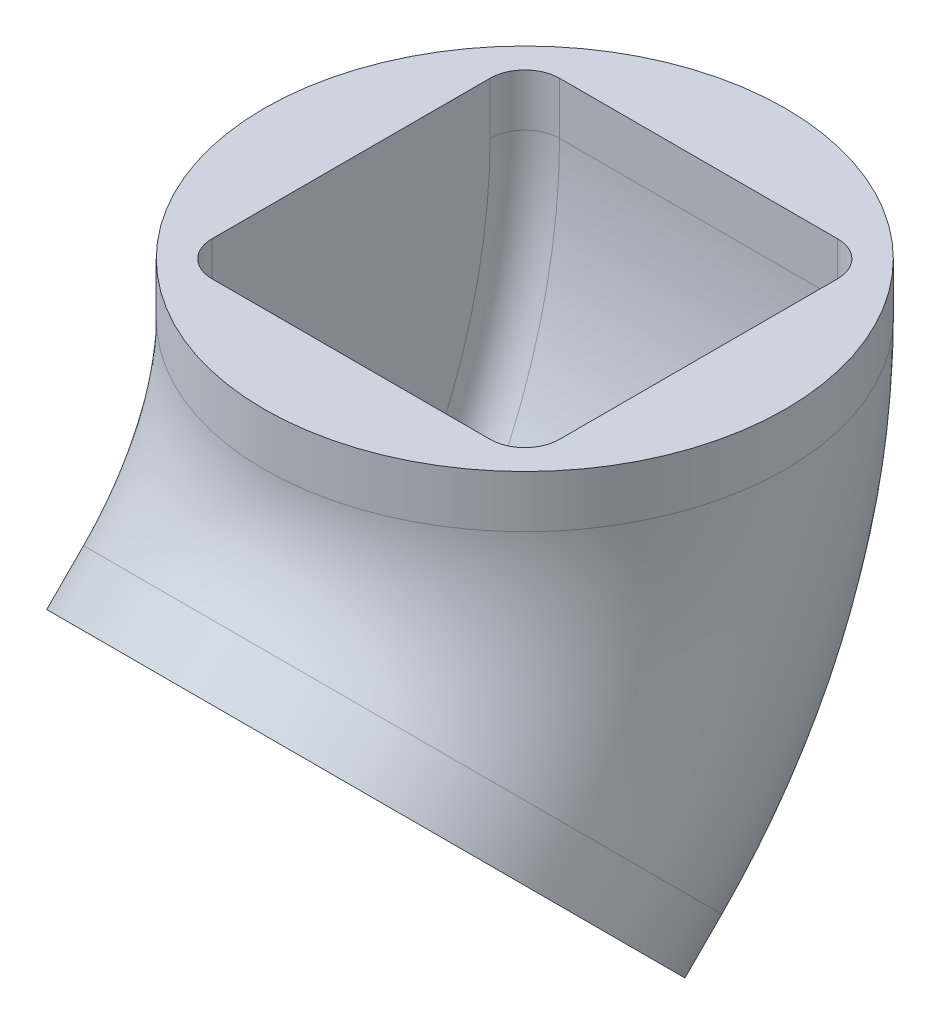
ISO-10303-21;
HEADER;
FILE_DESCRIPTION(('STEP AP214'),'2;1');
FILE_NAME('part.step','',(''),(''),'','','');
FILE_SCHEMA(('AUTOMOTIVE_DESIGN { 1 0 10303 214 1 1 1 1 }'));
ENDSEC;
DATA;
#1=APPLICATION_CONTEXT('core data for automotive mechanical design processes');
#2=APPLICATION_PROTOCOL_DEFINITION('international standard','automotive_design',2000,#1);
#3=PRODUCT_CONTEXT('',#1,'mechanical');
#4=PRODUCT('Part','Part','',(#3));
#5=PRODUCT_RELATED_PRODUCT_CATEGORY('part','',(#4));
#6=PRODUCT_DEFINITION_FORMATION('','',#4);
#7=PRODUCT_DEFINITION_CONTEXT('part definition',#1,'design');
#8=PRODUCT_DEFINITION('design','',#6,#7);
#9=PRODUCT_DEFINITION_SHAPE('','',#8);
#10=(LENGTH_UNIT() NAMED_UNIT(*) SI_UNIT(.MILLI.,.METRE.));
#11=(NAMED_UNIT(*) PLANE_ANGLE_UNIT() SI_UNIT($,.RADIAN.));
#12=(NAMED_UNIT(*) SI_UNIT($,.STERADIAN.) SOLID_ANGLE_UNIT());
#13=UNCERTAINTY_MEASURE_WITH_UNIT(LENGTH_MEASURE(1.E-05),#10,'distance_accuracy_value','');
#14=(GEOMETRIC_REPRESENTATION_CONTEXT(3) GLOBAL_UNCERTAINTY_ASSIGNED_CONTEXT((#13)) GLOBAL_UNIT_ASSIGNED_CONTEXT((#10,
#11,#12)) REPRESENTATION_CONTEXT('',''));
#15=CARTESIAN_POINT('',(0.,0.,0.));
#16=DIRECTION('',(0.,0.,1.));
#17=DIRECTION('',(1.,0.,0.));
#18=AXIS2_PLACEMENT_3D('',#15,#16,#17);
#19=CARTESIAN_POINT('',(0.,-84.8528137423858,35.1471862576145));
#20=DIRECTION('',(0.,-0.707106781186546,0.707106781186548));
#21=DIRECTION('',(0.,-0.707106781186549,-0.707106781186547));
#22=AXIS2_PLACEMENT_3D('',#19,#20,#21);
#23=PLANE('',#22);
#24=DIRECTION('',(0.,0.707106781186549,0.707106781186547));
#25=VECTOR('',#24,1.);
#26=CARTESIAN_POINT('',(50.,-113.137084989848,6.86291501015256));
#27=LINE('',#26,#25);
#28=CARTESIAN_POINT('',(50.,-57.7511532766505,62.2488467233497));
#29=VERTEX_POINT('',#28);
#30=CARTESIAN_POINT('',(50.,-111.954474208121,8.04552579187919));
#31=VERTEX_POINT('',#30);
#32=EDGE_CURVE('E180',#29,#31,#27,.F.);
#33=ORIENTED_EDGE('',*,*,#32,.T.);
#34=CARTESIAN_POINT('',(0.,-84.8528137423858,35.1471862576144));
#35=DIRECTION('',(0.,-0.707106781186547,0.707106781186548));
#36=DIRECTION('',(0.,-0.707106781186548,-0.707106781186547));
#37=AXIS2_PLACEMENT_3D('',#34,#35,#36);
#38=CIRCLE('',#37,63.);
#39=EDGE_CURVE('E11',#31,#29,#38,.T.);
#40=ORIENTED_EDGE('',*,*,#39,.T.);
#41=EDGE_LOOP('',(#33,#40));
#42=FACE_BOUND('',#41,.T.);
#43=ADVANCED_FACE('F43',(#42),#23,.T.);
#44=DIRECTION('',(-1.,0.,0.));
#45=VECTOR('',#44,1.);
#46=CARTESIAN_POINT('',(40.,-49.4974746830584,70.5025253169418));
#47=LINE('',#46,#45);
#48=CARTESIAN_POINT('',(-38.3275357934736,-49.4974746830584,70.5025253169418));
#49=VERTEX_POINT('',#48);
#50=CARTESIAN_POINT('',(38.3275357934736,-49.4974746830584,70.5025253169418));
#51=VERTEX_POINT('',#50);
#52=EDGE_CURVE('E296',#49,#51,#47,.F.);
#53=ORIENTED_EDGE('',*,*,#52,.T.);
#54=EDGE_CURVE('E52',#51,#49,#38,.T.);
#55=ORIENTED_EDGE('',*,*,#54,.T.);
#56=EDGE_LOOP('',(#53,#55));
#57=FACE_BOUND('',#56,.T.);
#58=ADVANCED_FACE('F316',(#57),#23,.T.);
#59=DIRECTION('',(0.,-0.707106781186549,-0.707106781186547));
#60=VECTOR('',#59,1.);
#61=CARTESIAN_POINT('',(-50.,-56.5685424949239,63.4314575050763));
#62=LINE('',#61,#60);
#63=CARTESIAN_POINT('',(-50.,-111.954474208121,8.04552579187919));
#64=VERTEX_POINT('',#63);
#65=CARTESIAN_POINT('',(-50.,-57.7511532766505,62.2488467233497));
#66=VERTEX_POINT('',#65);
#67=EDGE_CURVE('E210',#64,#66,#62,.F.);
#68=ORIENTED_EDGE('',*,*,#67,.T.);
#69=EDGE_CURVE('E276',#66,#64,#38,.T.);
#70=ORIENTED_EDGE('',*,*,#69,.T.);
#71=EDGE_LOOP('',(#68,#70));
#72=FACE_BOUND('',#71,.T.);
#73=ADVANCED_FACE('F334',(#72),#23,.T.);
#74=DIRECTION('',(1.,0.,0.));
#75=VECTOR('',#74,1.);
#76=CARTESIAN_POINT('',(-40.,-120.208152801713,-0.208152801712901));
#77=LINE('',#76,#75);
#78=CARTESIAN_POINT('',(38.3275357934736,-120.208152801713,-0.208152801712908));
#79=VERTEX_POINT('',#78);
#80=CARTESIAN_POINT('',(-38.3275357934736,-120.208152801713,-0.208152801712908));
#81=VERTEX_POINT('',#80);
#82=EDGE_CURVE('E198',#79,#81,#77,.F.);
#83=ORIENTED_EDGE('',*,*,#82,.T.);
#84=EDGE_CURVE('E174',#81,#79,#38,.T.);
#85=ORIENTED_EDGE('',*,*,#84,.T.);
#86=EDGE_LOOP('',(#83,#85));
#87=FACE_BOUND('',#86,.T.);
#88=ADVANCED_FACE('F331',(#87),#23,.T.);
#89=CARTESIAN_POINT('',(0.,15.,0.));
#90=DIRECTION('',(0.,1.,0.));
#91=DIRECTION('',(0.,0.,1.));
#92=AXIS2_PLACEMENT_3D('',#89,#90,#91);
#93=PLANE('',#92);
#94=CARTESIAN_POINT('',(0.,15.,0.));
#95=DIRECTION('',(0.,1.,0.));
#96=DIRECTION('',(0.,0.,1.));
#97=AXIS2_PLACEMENT_3D('',#94,#95,#96);
#98=CIRCLE('',#97,75.);
#99=CARTESIAN_POINT('',(0.,15.,75.));
#100=VERTEX_POINT('',#99);
#101=EDGE_CURVE('E231',#100,#100,#98,.T.);
#102=ORIENTED_EDGE('',*,*,#101,.T.);
#103=EDGE_LOOP('',(#102));
#104=FACE_BOUND('',#103,.T.);
#105=DIRECTION('',(-1.,0.,0.));
#106=VECTOR('',#105,1.);
#107=CARTESIAN_POINT('',(-50.,15.,-50.));
#108=LINE('',#107,#106);
#109=CARTESIAN_POINT('',(40.,15.,-50.));
#110=VERTEX_POINT('',#109);
#111=CARTESIAN_POINT('',(-40.,15.,-50.));
#112=VERTEX_POINT('',#111);
#113=EDGE_CURVE('E222',#110,#112,#108,.T.);
#114=ORIENTED_EDGE('',*,*,#113,.F.);
#115=CARTESIAN_POINT('',(40.,15.,-40.));
#116=DIRECTION('',(0.,1.,0.));
#117=DIRECTION('',(0.,0.,1.));
#118=AXIS2_PLACEMENT_3D('',#115,#116,#117);
#119=CIRCLE('',#118,10.);
#120=CARTESIAN_POINT('',(50.,15.,-40.));
#121=VERTEX_POINT('',#120);
#122=EDGE_CURVE('E47',#110,#121,#119,.F.);
#123=ORIENTED_EDGE('',*,*,#122,.T.);
#124=DIRECTION('',(0.,0.,-1.));
#125=VECTOR('',#124,1.);
#126=CARTESIAN_POINT('',(50.,15.,50.));
#127=LINE('',#126,#125);
#128=CARTESIAN_POINT('',(50.,15.,40.));
#129=VERTEX_POINT('',#128);
#130=EDGE_CURVE('E219',#129,#121,#127,.T.);
#131=ORIENTED_EDGE('',*,*,#130,.F.);
#132=CARTESIAN_POINT('',(40.,15.,40.));
#133=DIRECTION('',(0.,1.,0.));
#134=DIRECTION('',(0.,0.,1.));
#135=AXIS2_PLACEMENT_3D('',#132,#133,#134);
#136=CIRCLE('',#135,10.);
#137=CARTESIAN_POINT('',(40.,15.,50.));
#138=VERTEX_POINT('',#137);
#139=EDGE_CURVE('E260',#129,#138,#136,.F.);
#140=ORIENTED_EDGE('',*,*,#139,.T.);
#141=DIRECTION('',(1.,0.,0.));
#142=VECTOR('',#141,1.);
#143=CARTESIAN_POINT('',(-50.,15.,50.));
#144=LINE('',#143,#142);
#145=CARTESIAN_POINT('',(-40.,15.,50.));
#146=VERTEX_POINT('',#145);
#147=EDGE_CURVE('E228',#146,#138,#144,.T.);
#148=ORIENTED_EDGE('',*,*,#147,.F.);
#149=CARTESIAN_POINT('',(-40.,15.,40.));
#150=DIRECTION('',(0.,1.,0.));
#151=DIRECTION('',(0.,0.,1.));
#152=AXIS2_PLACEMENT_3D('',#149,#150,#151);
#153=CIRCLE('',#152,10.);
#154=CARTESIAN_POINT('',(-50.,15.,40.));
#155=VERTEX_POINT('',#154);
#156=EDGE_CURVE('E265',#146,#155,#153,.F.);
#157=ORIENTED_EDGE('',*,*,#156,.T.);
#158=DIRECTION('',(0.,0.,1.));
#159=VECTOR('',#158,1.);
#160=CARTESIAN_POINT('',(-50.,15.,50.));
#161=LINE('',#160,#159);
#162=CARTESIAN_POINT('',(-50.,15.,-40.));
#163=VERTEX_POINT('',#162);
#164=EDGE_CURVE('E225',#163,#155,#161,.T.);
#165=ORIENTED_EDGE('',*,*,#164,.F.);
#166=CARTESIAN_POINT('',(-40.,15.,-40.));
#167=DIRECTION('',(0.,1.,0.));
#168=DIRECTION('',(0.,0.,1.));
#169=AXIS2_PLACEMENT_3D('',#166,#167,#168);
#170=CIRCLE('',#169,10.);
#171=EDGE_CURVE('E69',#163,#112,#170,.F.);
#172=ORIENTED_EDGE('',*,*,#171,.T.);
#173=EDGE_LOOP('',(#114,#123,#131,#140,#148,#157,#165,#172));
#174=FACE_BOUND('',#173,.T.);
#175=ADVANCED_FACE('F333',(#104,#174),#93,.T.);
#176=CARTESIAN_POINT('',(0.,15.,0.));
#177=DIRECTION('',(0.,-1.,0.));
#178=DIRECTION('',(0.,0.,-1.));
#179=AXIS2_PLACEMENT_3D('',#176,#177,#178);
#180=CYLINDRICAL_SURFACE('',#179,75.);
#181=ORIENTED_EDGE('',*,*,#101,.F.);
#182=EDGE_LOOP('',(#181));
#183=FACE_BOUND('',#182,.T.);
#184=CARTESIAN_POINT('',(0.,0.,0.));
#185=DIRECTION('',(0.,-1.,0.));
#186=DIRECTION('',(0.,0.,-1.));
#187=AXIS2_PLACEMENT_3D('',#184,#185,#186);
#188=CIRCLE('',#187,75.);
#189=CARTESIAN_POINT('',(0.,0.,-75.));
#190=VERTEX_POINT('',#189);
#191=EDGE_CURVE('E215',#190,#190,#188,.T.);
#192=ORIENTED_EDGE('',*,*,#191,.F.);
#193=EDGE_LOOP('',(#192));
#194=FACE_BOUND('',#193,.T.);
#195=ADVANCED_FACE('F341',(#183,#194),#180,.T.);
#196=CARTESIAN_POINT('',(50.,15.,50.));
#197=DIRECTION('',(-1.,0.,0.));
#198=DIRECTION('',(0.,0.,1.));
#199=AXIS2_PLACEMENT_3D('',#196,#197,#198);
#200=PLANE('',#199);
#201=DIRECTION('',(0.,-1.,0.));
#202=VECTOR('',#201,1.);
#203=CARTESIAN_POINT('',(50.,0.,-40.));
#204=LINE('',#203,#202);
#205=CARTESIAN_POINT('',(50.,0.,-40.));
#206=VERTEX_POINT('',#205);
#207=EDGE_CURVE('E243',#121,#206,#204,.T.);
#208=ORIENTED_EDGE('',*,*,#207,.T.);
#209=CARTESIAN_POINT('',(50.,0.,120.));
#210=DIRECTION('',(-1.,0.,0.));
#211=DIRECTION('',(0.,0.,-1.));
#212=AXIS2_PLACEMENT_3D('',#209,#210,#211);
#213=CIRCLE('',#212,160.);
#214=CARTESIAN_POINT('',(50.,-113.137084989848,6.86291501015256));
#215=VERTEX_POINT('',#214);
#216=EDGE_CURVE('E182',#206,#215,#213,.T.);
#217=ORIENTED_EDGE('',*,*,#216,.T.);
#218=EDGE_CURVE('E167',#31,#215,#27,.F.);
#219=ORIENTED_EDGE('',*,*,#218,.F.);
#220=ORIENTED_EDGE('',*,*,#32,.F.);
#221=CARTESIAN_POINT('',(50.,-56.5685424949239,63.4314575050763));
#222=VERTEX_POINT('',#221);
#223=EDGE_CURVE('E185',#222,#29,#27,.F.);
#224=ORIENTED_EDGE('',*,*,#223,.F.);
#225=CARTESIAN_POINT('',(50.,0.,120.));
#226=DIRECTION('',(-1.,0.,0.));
#227=DIRECTION('',(0.,0.,-1.));
#228=AXIS2_PLACEMENT_3D('',#225,#226,#227);
#229=CIRCLE('',#228,80.);
#230=CARTESIAN_POINT('',(50.,0.,40.));
#231=VERTEX_POINT('',#230);
#232=EDGE_CURVE('E183',#231,#222,#229,.T.);
#233=ORIENTED_EDGE('',*,*,#232,.F.);
#234=DIRECTION('',(0.,-1.,0.));
#235=VECTOR('',#234,1.);
#236=CARTESIAN_POINT('',(50.,15.,40.));
#237=LINE('',#236,#235);
#238=EDGE_CURVE('E245',#231,#129,#237,.F.);
#239=ORIENTED_EDGE('',*,*,#238,.T.);
#240=ORIENTED_EDGE('',*,*,#130,.T.);
#241=EDGE_LOOP('',(#208,#217,#219,#220,#224,#233,#239,#240));
#242=FACE_BOUND('',#241,.T.);
#243=ADVANCED_FACE('F178',(#242),#200,.T.);
#244=CARTESIAN_POINT('',(-50.,15.,-50.));
#245=DIRECTION('',(0.,0.,1.));
#246=DIRECTION('',(1.,0.,0.));
#247=AXIS2_PLACEMENT_3D('',#244,#245,#246);
#248=PLANE('',#247);
#249=ORIENTED_EDGE('',*,*,#113,.T.);
#250=DIRECTION('',(0.,-1.,0.));
#251=VECTOR('',#250,1.);
#252=CARTESIAN_POINT('',(-40.,0.,-50.));
#253=LINE('',#252,#251);
#254=CARTESIAN_POINT('',(-40.,0.,-50.));
#255=VERTEX_POINT('',#254);
#256=EDGE_CURVE('E254',#112,#255,#253,.T.);
#257=ORIENTED_EDGE('',*,*,#256,.T.);
#258=DIRECTION('',(-1.,0.,0.));
#259=VECTOR('',#258,1.);
#260=CARTESIAN_POINT('',(-50.,0.,-50.));
#261=LINE('',#260,#259);
#262=CARTESIAN_POINT('',(40.,0.,-50.));
#263=VERTEX_POINT('',#262);
#264=EDGE_CURVE('E209',#263,#255,#261,.T.);
#265=ORIENTED_EDGE('',*,*,#264,.F.);
#266=DIRECTION('',(0.,-1.,0.));
#267=VECTOR('',#266,1.);
#268=CARTESIAN_POINT('',(40.,15.,-50.));
#269=LINE('',#268,#267);
#270=EDGE_CURVE('E252',#263,#110,#269,.F.);
#271=ORIENTED_EDGE('',*,*,#270,.T.);
#272=EDGE_LOOP('',(#249,#257,#265,#271));
#273=FACE_BOUND('',#272,.T.);
#274=ADVANCED_FACE('F469',(#273),#248,.T.);
#275=CARTESIAN_POINT('',(-50.,15.,50.));
#276=DIRECTION('',(1.,0.,0.));
#277=DIRECTION('',(0.,0.,-1.));
#278=AXIS2_PLACEMENT_3D('',#275,#276,#277);
#279=PLANE('',#278);
#280=ORIENTED_EDGE('',*,*,#164,.T.);
#281=DIRECTION('',(0.,-1.,0.));
#282=VECTOR('',#281,1.);
#283=CARTESIAN_POINT('',(-50.,0.,40.));
#284=LINE('',#283,#282);
#285=CARTESIAN_POINT('',(-50.,0.,40.));
#286=VERTEX_POINT('',#285);
#287=EDGE_CURVE('E249',#155,#286,#284,.T.);
#288=ORIENTED_EDGE('',*,*,#287,.T.);
#289=CARTESIAN_POINT('',(-50.,0.,120.));
#290=DIRECTION('',(-1.,0.,0.));
#291=DIRECTION('',(0.,0.,-1.));
#292=AXIS2_PLACEMENT_3D('',#289,#290,#291);
#293=CIRCLE('',#292,80.);
#294=CARTESIAN_POINT('',(-50.,-56.5685424949239,63.4314575050763));
#295=VERTEX_POINT('',#294);
#296=EDGE_CURVE('E214',#286,#295,#293,.T.);
#297=ORIENTED_EDGE('',*,*,#296,.T.);
#298=EDGE_CURVE('E206',#66,#295,#62,.F.);
#299=ORIENTED_EDGE('',*,*,#298,.F.);
#300=ORIENTED_EDGE('',*,*,#67,.F.);
#301=CARTESIAN_POINT('',(-50.,-113.137084989848,6.86291501015256));
#302=VERTEX_POINT('',#301);
#303=EDGE_CURVE('E207',#302,#64,#62,.F.);
#304=ORIENTED_EDGE('',*,*,#303,.F.);
#305=CARTESIAN_POINT('',(-50.,0.,120.));
#306=DIRECTION('',(-1.,0.,0.));
#307=DIRECTION('',(0.,0.,-1.));
#308=AXIS2_PLACEMENT_3D('',#305,#306,#307);
#309=CIRCLE('',#308,160.);
#310=CARTESIAN_POINT('',(-50.,0.,-40.));
#311=VERTEX_POINT('',#310);
#312=EDGE_CURVE('E203',#311,#302,#309,.T.);
#313=ORIENTED_EDGE('',*,*,#312,.F.);
#314=DIRECTION('',(0.,-1.,0.));
#315=VECTOR('',#314,1.);
#316=CARTESIAN_POINT('',(-50.,15.,-40.));
#317=LINE('',#316,#315);
#318=EDGE_CURVE('E247',#311,#163,#317,.F.);
#319=ORIENTED_EDGE('',*,*,#318,.T.);
#320=EDGE_LOOP('',(#280,#288,#297,#299,#300,#304,#313,#319));
#321=FACE_BOUND('',#320,.T.);
#322=ADVANCED_FACE('F460',(#321),#279,.T.);
#323=CARTESIAN_POINT('',(-50.,15.,50.));
#324=DIRECTION('',(0.,0.,-1.));
#325=DIRECTION('',(-1.,0.,0.));
#326=AXIS2_PLACEMENT_3D('',#323,#324,#325);
#327=PLANE('',#326);
#328=ORIENTED_EDGE('',*,*,#147,.T.);
#329=DIRECTION('',(0.,-1.,0.));
#330=VECTOR('',#329,1.);
#331=CARTESIAN_POINT('',(40.,0.,50.));
#332=LINE('',#331,#330);
#333=CARTESIAN_POINT('',(40.,0.,50.));
#334=VERTEX_POINT('',#333);
#335=EDGE_CURVE('E240',#138,#334,#332,.T.);
#336=ORIENTED_EDGE('',*,*,#335,.T.);
#337=DIRECTION('',(1.,0.,0.));
#338=VECTOR('',#337,1.);
#339=CARTESIAN_POINT('',(-50.,0.,50.));
#340=LINE('',#339,#338);
#341=CARTESIAN_POINT('',(-40.,0.,50.));
#342=VERTEX_POINT('',#341);
#343=EDGE_CURVE('E223',#342,#334,#340,.T.);
#344=ORIENTED_EDGE('',*,*,#343,.F.);
#345=DIRECTION('',(0.,-1.,0.));
#346=VECTOR('',#345,1.);
#347=CARTESIAN_POINT('',(-40.,15.,50.));
#348=LINE('',#347,#346);
#349=EDGE_CURVE('E238',#342,#146,#348,.F.);
#350=ORIENTED_EDGE('',*,*,#349,.T.);
#351=EDGE_LOOP('',(#328,#336,#344,#350));
#352=FACE_BOUND('',#351,.T.);
#353=ADVANCED_FACE('F451',(#352),#327,.T.);
#354=CARTESIAN_POINT('',(40.,15.,40.));
#355=DIRECTION('',(0.,1.,0.));
#356=DIRECTION('',(0.,0.,1.));
#357=AXIS2_PLACEMENT_3D('',#354,#355,#356);
#358=CYLINDRICAL_SURFACE('',#357,10.);
#359=ORIENTED_EDGE('',*,*,#139,.F.);
#360=ORIENTED_EDGE('',*,*,#238,.F.);
#361=CARTESIAN_POINT('',(40.,0.,40.));
#362=DIRECTION('',(0.,1.,0.));
#363=DIRECTION('',(0.,0.,1.));
#364=AXIS2_PLACEMENT_3D('',#361,#362,#363);
#365=CIRCLE('',#364,10.);
#366=EDGE_CURVE('E257',#334,#231,#365,.T.);
#367=ORIENTED_EDGE('',*,*,#366,.F.);
#368=ORIENTED_EDGE('',*,*,#335,.F.);
#369=EDGE_LOOP('',(#359,#360,#367,#368));
#370=FACE_BOUND('',#369,.T.);
#371=ADVANCED_FACE('F442',(#370),#358,.F.);
#372=CARTESIAN_POINT('',(-40.,15.,40.));
#373=DIRECTION('',(0.,1.,0.));
#374=DIRECTION('',(0.,0.,1.));
#375=AXIS2_PLACEMENT_3D('',#372,#373,#374);
#376=CYLINDRICAL_SURFACE('',#375,10.);
#377=ORIENTED_EDGE('',*,*,#156,.F.);
#378=ORIENTED_EDGE('',*,*,#349,.F.);
#379=CARTESIAN_POINT('',(-40.,0.,40.));
#380=DIRECTION('',(0.,1.,0.));
#381=DIRECTION('',(0.,0.,1.));
#382=AXIS2_PLACEMENT_3D('',#379,#380,#381);
#383=CIRCLE('',#382,10.);
#384=EDGE_CURVE('E262',#286,#342,#383,.T.);
#385=ORIENTED_EDGE('',*,*,#384,.F.);
#386=ORIENTED_EDGE('',*,*,#287,.F.);
#387=EDGE_LOOP('',(#377,#378,#385,#386));
#388=FACE_BOUND('',#387,.T.);
#389=ADVANCED_FACE('F434',(#388),#376,.F.);
#390=CARTESIAN_POINT('',(-40.,15.,-40.));
#391=DIRECTION('',(0.,1.,0.));
#392=DIRECTION('',(0.,0.,1.));
#393=AXIS2_PLACEMENT_3D('',#390,#391,#392);
#394=CYLINDRICAL_SURFACE('',#393,10.);
#395=ORIENTED_EDGE('',*,*,#171,.F.);
#396=ORIENTED_EDGE('',*,*,#318,.F.);
#397=CARTESIAN_POINT('',(-40.,0.,-40.));
#398=DIRECTION('',(0.,1.,0.));
#399=DIRECTION('',(0.,0.,1.));
#400=AXIS2_PLACEMENT_3D('',#397,#398,#399);
#401=CIRCLE('',#400,10.);
#402=EDGE_CURVE('E267',#255,#311,#401,.T.);
#403=ORIENTED_EDGE('',*,*,#402,.F.);
#404=ORIENTED_EDGE('',*,*,#256,.F.);
#405=EDGE_LOOP('',(#395,#396,#403,#404));
#406=FACE_BOUND('',#405,.T.);
#407=ADVANCED_FACE('F425',(#406),#394,.F.);
#408=CARTESIAN_POINT('',(40.,15.,-40.));
#409=DIRECTION('',(0.,1.,0.));
#410=DIRECTION('',(0.,0.,1.));
#411=AXIS2_PLACEMENT_3D('',#408,#409,#410);
#412=CYLINDRICAL_SURFACE('',#411,10.);
#413=ORIENTED_EDGE('',*,*,#122,.F.);
#414=ORIENTED_EDGE('',*,*,#270,.F.);
#415=CARTESIAN_POINT('',(40.,0.,-40.));
#416=DIRECTION('',(0.,1.,0.));
#417=DIRECTION('',(0.,0.,1.));
#418=AXIS2_PLACEMENT_3D('',#415,#416,#417);
#419=CIRCLE('',#418,10.);
#420=EDGE_CURVE('E270',#206,#263,#419,.T.);
#421=ORIENTED_EDGE('',*,*,#420,.F.);
#422=ORIENTED_EDGE('',*,*,#207,.F.);
#423=EDGE_LOOP('',(#413,#414,#421,#422));
#424=FACE_BOUND('',#423,.T.);
#425=ADVANCED_FACE('F45',(#424),#412,.F.);
#426=CARTESIAN_POINT('',(0.,0.,120.));
#427=DIRECTION('',(-1.,0.,0.));
#428=DIRECTION('',(0.,0.,1.));
#429=AXIS2_PLACEMENT_3D('',#426,#427,#428);
#430=TOROIDAL_SURFACE('',#429,120.,75.);
#431=CARTESIAN_POINT('',(0.,-84.8528137423858,35.1471862576145));
#432=DIRECTION('',(0.,-0.707106781186546,0.707106781186548));
#433=DIRECTION('',(0.,-0.707106781186549,-0.707106781186547));
#434=AXIS2_PLACEMENT_3D('',#431,#432,#433);
#435=CIRCLE('',#434,75.);
#436=CARTESIAN_POINT('',(0.,-137.885822331377,-17.8858223313766));
#437=VERTEX_POINT('',#436);
#438=EDGE_CURVE('E211',#437,#437,#435,.T.);
#439=CARTESIAN_POINT('',(0.,0.,120.));
#440=DIRECTION('',(-1.,0.,0.));
#441=DIRECTION('',(0.,0.,1.));
#442=AXIS2_PLACEMENT_3D('',#439,#440,#441);
#443=CIRCLE('',#442,195.);
#444=EDGE_CURVE('',#190,#437,#443,.T.);
#445=ORIENTED_EDGE('',*,*,#191,.T.);
#446=ORIENTED_EDGE('',*,*,#438,.F.);
#447=ORIENTED_EDGE('',*,*,#444,.T.);
#448=ORIENTED_EDGE('',*,*,#444,.F.);
#449=EDGE_LOOP('',(#445,#447,#446,#448));
#450=FACE_BOUND('',#449,.T.);
#451=ADVANCED_FACE('F409',(#450),#430,.T.);
#452=CARTESIAN_POINT('',(-40.,0.,120.));
#453=DIRECTION('',(-1.,0.,0.));
#454=DIRECTION('',(0.,0.,1.));
#455=AXIS2_PLACEMENT_3D('',#452,#453,#454);
#456=TOROIDAL_SURFACE('',#455,80.,10.);
#457=CARTESIAN_POINT('',(-40.,0.,120.));
#458=DIRECTION('',(-1.,0.,0.));
#459=DIRECTION('',(0.,0.,-1.));
#460=AXIS2_PLACEMENT_3D('',#457,#458,#459);
#461=CIRCLE('',#460,70.);
#462=CARTESIAN_POINT('',(-40.,-49.4974746830584,70.5025253169418));
#463=VERTEX_POINT('',#462);
#464=EDGE_CURVE('E287',#342,#463,#461,.T.);
#465=ORIENTED_EDGE('',*,*,#464,.T.);
#466=CARTESIAN_POINT('',(-40.,-56.5685424949239,63.4314575050763));
#467=DIRECTION('',(0.,-0.707106781186546,0.707106781186548));
#468=DIRECTION('',(0.,-0.707106781186549,-0.707106781186547));
#469=AXIS2_PLACEMENT_3D('',#466,#467,#468);
#470=CIRCLE('',#469,10.);
#471=EDGE_CURVE('E285',#295,#463,#470,.F.);
#472=ORIENTED_EDGE('',*,*,#471,.F.);
#473=ORIENTED_EDGE('',*,*,#296,.F.);
#474=ORIENTED_EDGE('',*,*,#384,.T.);
#475=EDGE_LOOP('',(#465,#472,#473,#474));
#476=FACE_BOUND('',#475,.T.);
#477=ADVANCED_FACE('F401',(#476),#456,.F.);
#478=CARTESIAN_POINT('',(0.,0.,120.));
#479=DIRECTION('',(-1.,0.,0.));
#480=DIRECTION('',(0.,0.,1.));
#481=AXIS2_PLACEMENT_3D('',#478,#479,#480);
#482=CYLINDRICAL_SURFACE('',#481,70.);
#483=CARTESIAN_POINT('',(40.,0.,120.));
#484=DIRECTION('',(-1.,0.,0.));
#485=DIRECTION('',(0.,0.,-1.));
#486=AXIS2_PLACEMENT_3D('',#483,#484,#485);
#487=CIRCLE('',#486,70.);
#488=CARTESIAN_POINT('',(40.,-49.4974746830584,70.5025253169418));
#489=VERTEX_POINT('',#488);
#490=EDGE_CURVE('E295',#334,#489,#487,.T.);
#491=ORIENTED_EDGE('',*,*,#490,.T.);
#492=EDGE_CURVE('E290',#51,#489,#47,.F.);
#493=ORIENTED_EDGE('',*,*,#492,.F.);
#494=ORIENTED_EDGE('',*,*,#52,.F.);
#495=EDGE_CURVE('E293',#463,#49,#47,.F.);
#496=ORIENTED_EDGE('',*,*,#495,.F.);
#497=ORIENTED_EDGE('',*,*,#464,.F.);
#498=ORIENTED_EDGE('',*,*,#343,.T.);
#499=EDGE_LOOP('',(#491,#493,#494,#496,#497,#498));
#500=FACE_BOUND('',#499,.T.);
#501=ADVANCED_FACE('F312',(#500),#482,.T.);
#502=CARTESIAN_POINT('',(40.,0.,120.));
#503=DIRECTION('',(-1.,0.,0.));
#504=DIRECTION('',(0.,0.,1.));
#505=AXIS2_PLACEMENT_3D('',#502,#503,#504);
#506=TOROIDAL_SURFACE('',#505,80.,10.);
#507=ORIENTED_EDGE('',*,*,#232,.T.);
#508=CARTESIAN_POINT('',(40.,-56.5685424949239,63.4314575050763));
#509=DIRECTION('',(0.,-0.707106781186546,0.707106781186548));
#510=DIRECTION('',(0.,-0.707106781186549,-0.707106781186547));
#511=AXIS2_PLACEMENT_3D('',#508,#509,#510);
#512=CIRCLE('',#511,10.);
#513=EDGE_CURVE('E298',#489,#222,#512,.F.);
#514=ORIENTED_EDGE('',*,*,#513,.F.);
#515=ORIENTED_EDGE('',*,*,#490,.F.);
#516=ORIENTED_EDGE('',*,*,#366,.T.);
#517=EDGE_LOOP('',(#507,#514,#515,#516));
#518=FACE_BOUND('',#517,.T.);
#519=ADVANCED_FACE('F304',(#518),#506,.F.);
#520=CARTESIAN_POINT('',(40.,0.,120.));
#521=DIRECTION('',(-1.,0.,0.));
#522=DIRECTION('',(0.,0.,1.));
#523=AXIS2_PLACEMENT_3D('',#520,#521,#522);
#524=TOROIDAL_SURFACE('',#523,160.,10.);
#525=CARTESIAN_POINT('',(40.,0.,120.));
#526=DIRECTION('',(-1.,0.,0.));
#527=DIRECTION('',(0.,0.,-1.));
#528=AXIS2_PLACEMENT_3D('',#525,#526,#527);
#529=CIRCLE('',#528,170.);
#530=CARTESIAN_POINT('',(40.,-120.208152801713,-0.208152801712904));
#531=VERTEX_POINT('',#530);
#532=EDGE_CURVE('E192',#263,#531,#529,.T.);
#533=ORIENTED_EDGE('',*,*,#532,.T.);
#534=CARTESIAN_POINT('',(40.,-113.137084989848,6.86291501015256));
#535=DIRECTION('',(0.,-0.707106781186546,0.707106781186548));
#536=DIRECTION('',(0.,-0.707106781186549,-0.707106781186547));
#537=AXIS2_PLACEMENT_3D('',#534,#535,#536);
#538=CIRCLE('',#537,10.);
#539=EDGE_CURVE('E190',#215,#531,#538,.F.);
#540=ORIENTED_EDGE('',*,*,#539,.F.);
#541=ORIENTED_EDGE('',*,*,#216,.F.);
#542=ORIENTED_EDGE('',*,*,#420,.T.);
#543=EDGE_LOOP('',(#533,#540,#541,#542));
#544=FACE_BOUND('',#543,.T.);
#545=ADVANCED_FACE('F379',(#544),#524,.F.);
#546=CARTESIAN_POINT('',(0.,0.,120.));
#547=DIRECTION('',(-1.,0.,0.));
#548=DIRECTION('',(0.,0.,1.));
#549=AXIS2_PLACEMENT_3D('',#546,#547,#548);
#550=CYLINDRICAL_SURFACE('',#549,170.);
#551=CARTESIAN_POINT('',(-40.,0.,120.));
#552=DIRECTION('',(-1.,0.,0.));
#553=DIRECTION('',(0.,0.,-1.));
#554=AXIS2_PLACEMENT_3D('',#551,#552,#553);
#555=CIRCLE('',#554,170.);
#556=CARTESIAN_POINT('',(-40.,-120.208152801713,-0.208152801712904));
#557=VERTEX_POINT('',#556);
#558=EDGE_CURVE('E197',#255,#557,#555,.T.);
#559=ORIENTED_EDGE('',*,*,#558,.T.);
#560=EDGE_CURVE('E195',#81,#557,#77,.F.);
#561=ORIENTED_EDGE('',*,*,#560,.F.);
#562=ORIENTED_EDGE('',*,*,#82,.F.);
#563=EDGE_CURVE('E170',#531,#79,#77,.F.);
#564=ORIENTED_EDGE('',*,*,#563,.F.);
#565=ORIENTED_EDGE('',*,*,#532,.F.);
#566=ORIENTED_EDGE('',*,*,#264,.T.);
#567=EDGE_LOOP('',(#559,#561,#562,#564,#565,#566));
#568=FACE_BOUND('',#567,.T.);
#569=ADVANCED_FACE('F329',(#568),#550,.F.);
#570=CARTESIAN_POINT('',(-40.,0.,120.));
#571=DIRECTION('',(-1.,0.,0.));
#572=DIRECTION('',(0.,0.,1.));
#573=AXIS2_PLACEMENT_3D('',#570,#571,#572);
#574=TOROIDAL_SURFACE('',#573,160.,10.);
#575=ORIENTED_EDGE('',*,*,#312,.T.);
#576=CARTESIAN_POINT('',(-40.,-113.137084989848,6.86291501015257));
#577=DIRECTION('',(0.,-0.707106781186546,0.707106781186548));
#578=DIRECTION('',(0.,-0.707106781186549,-0.707106781186547));
#579=AXIS2_PLACEMENT_3D('',#576,#577,#578);
#580=CIRCLE('',#579,10.);
#581=EDGE_CURVE('E201',#557,#302,#580,.F.);
#582=ORIENTED_EDGE('',*,*,#581,.F.);
#583=ORIENTED_EDGE('',*,*,#558,.F.);
#584=ORIENTED_EDGE('',*,*,#402,.T.);
#585=EDGE_LOOP('',(#575,#582,#583,#584));
#586=FACE_BOUND('',#585,.T.);
#587=ADVANCED_FACE('F368',(#586),#574,.F.);
#588=CARTESIAN_POINT('',(0.,-84.8528137423858,35.1471862576144));
#589=DIRECTION('',(0.,-0.707106781186547,0.707106781186548));
#590=DIRECTION('',(0.,-0.707106781186548,-0.707106781186547));
#591=AXIS2_PLACEMENT_3D('',#588,#589,#590);
#592=PLANE('',#591);
#593=EDGE_CURVE('E54',#29,#51,#38,.T.);
#594=ORIENTED_EDGE('',*,*,#593,.T.);
#595=ORIENTED_EDGE('',*,*,#492,.T.);
#596=ORIENTED_EDGE('',*,*,#513,.T.);
#597=ORIENTED_EDGE('',*,*,#223,.T.);
#598=EDGE_LOOP('',(#594,#595,#596,#597));
#599=FACE_BOUND('',#598,.T.);
#600=ADVANCED_FACE('F306',(#599),#592,.F.);
#601=EDGE_CURVE('E61',#79,#31,#38,.T.);
#602=ORIENTED_EDGE('',*,*,#601,.T.);
#603=ORIENTED_EDGE('',*,*,#218,.T.);
#604=ORIENTED_EDGE('',*,*,#539,.T.);
#605=ORIENTED_EDGE('',*,*,#563,.T.);
#606=EDGE_LOOP('',(#602,#603,#604,#605));
#607=FACE_BOUND('',#606,.T.);
#608=ADVANCED_FACE('F166',(#607),#592,.F.);
#609=EDGE_CURVE('E173',#64,#81,#38,.T.);
#610=ORIENTED_EDGE('',*,*,#609,.T.);
#611=ORIENTED_EDGE('',*,*,#560,.T.);
#612=ORIENTED_EDGE('',*,*,#581,.T.);
#613=ORIENTED_EDGE('',*,*,#303,.T.);
#614=EDGE_LOOP('',(#610,#611,#612,#613));
#615=FACE_BOUND('',#614,.T.);
#616=ADVANCED_FACE('F325',(#615),#592,.F.);
#617=ORIENTED_EDGE('',*,*,#471,.T.);
#618=ORIENTED_EDGE('',*,*,#495,.T.);
#619=EDGE_CURVE('E308',#49,#66,#38,.T.);
#620=ORIENTED_EDGE('',*,*,#619,.T.);
#621=ORIENTED_EDGE('',*,*,#298,.T.);
#622=EDGE_LOOP('',(#617,#618,#620,#621));
#623=FACE_BOUND('',#622,.T.);
#624=ADVANCED_FACE('F520',(#623),#592,.F.);
#625=CARTESIAN_POINT('',(0.,-95.459415460184,45.7537879754127));
#626=DIRECTION('',(0.,-0.707106781186547,0.707106781186548));
#627=DIRECTION('',(0.,-0.707106781186548,-0.707106781186547));
#628=AXIS2_PLACEMENT_3D('',#625,#626,#627);
#629=PLANE('',#628);
#630=CARTESIAN_POINT('',(0.,-95.459415460184,45.7537879754127));
#631=DIRECTION('',(0.,-0.707106781186547,0.707106781186548));
#632=DIRECTION('',(0.,-0.707106781186548,-0.707106781186547));
#633=AXIS2_PLACEMENT_3D('',#630,#631,#632);
#634=CIRCLE('',#633,75.);
#635=CARTESIAN_POINT('',(0.,-148.492424049175,-7.27922061357836));
#636=VERTEX_POINT('',#635);
#637=EDGE_CURVE('E218',#636,#636,#634,.T.);
#638=ORIENTED_EDGE('',*,*,#637,.T.);
#639=EDGE_LOOP('',(#638));
#640=FACE_BOUND('',#639,.T.);
#641=CARTESIAN_POINT('',(0.,-95.459415460184,45.7537879754127));
#642=DIRECTION('',(0.,-0.707106781186547,0.707106781186548));
#643=DIRECTION('',(0.,-0.707106781186548,-0.707106781186547));
#644=AXIS2_PLACEMENT_3D('',#641,#642,#643);
#645=CIRCLE('',#644,63.);
#646=CARTESIAN_POINT('',(0.,-140.007142674937,1.20606076066023));
#647=VERTEX_POINT('',#646);
#648=EDGE_CURVE('E172',#647,#647,#645,.T.);
#649=ORIENTED_EDGE('',*,*,#648,.F.);
#650=EDGE_LOOP('',(#649));
#651=FACE_BOUND('',#650,.T.);
#652=ADVANCED_FACE('F530',(#640,#651),#629,.T.);
#653=CARTESIAN_POINT('',(0.,-95.459415460184,45.7537879754127));
#654=DIRECTION('',(0.,0.707106781186547,-0.707106781186548));
#655=DIRECTION('',(0.,0.707106781186548,0.707106781186547));
#656=AXIS2_PLACEMENT_3D('',#653,#654,#655);
#657=CYLINDRICAL_SURFACE('',#656,75.);
#658=ORIENTED_EDGE('',*,*,#637,.F.);
#659=EDGE_LOOP('',(#658));
#660=FACE_BOUND('',#659,.T.);
#661=ORIENTED_EDGE('',*,*,#438,.T.);
#662=EDGE_LOOP('',(#661));
#663=FACE_BOUND('',#662,.T.);
#664=ADVANCED_FACE('F536',(#660,#663),#657,.T.);
#665=CARTESIAN_POINT('',(0.,-95.459415460184,45.7537879754127));
#666=DIRECTION('',(0.,0.707106781186547,-0.707106781186548));
#667=DIRECTION('',(0.,0.707106781186548,0.707106781186547));
#668=AXIS2_PLACEMENT_3D('',#665,#666,#667);
#669=CYLINDRICAL_SURFACE('',#668,63.);
#670=ORIENTED_EDGE('',*,*,#648,.T.);
#671=EDGE_LOOP('',(#670));
#672=FACE_BOUND('',#671,.T.);
#673=ORIENTED_EDGE('',*,*,#601,.F.);
#674=ORIENTED_EDGE('',*,*,#84,.F.);
#675=ORIENTED_EDGE('',*,*,#609,.F.);
#676=ORIENTED_EDGE('',*,*,#69,.F.);
#677=ORIENTED_EDGE('',*,*,#619,.F.);
#678=ORIENTED_EDGE('',*,*,#54,.F.);
#679=ORIENTED_EDGE('',*,*,#593,.F.);
#680=ORIENTED_EDGE('',*,*,#39,.F.);
#681=EDGE_LOOP('',(#673,#674,#675,#676,#677,#678,#679,#680));
#682=FACE_BOUND('',#681,.T.);
#683=ADVANCED_FACE('F159',(#672,#682),#669,.F.);
#684=CLOSED_SHELL('',(#43,#58,#73,#88,#175,#195,#243,#274,#322,#353,#371,#389,#407,#425,#451,
#477,#501,#519,#545,#569,#587,#600,#608,#616,#624,#652,#664,#683));
#685=MANIFOLD_SOLID_BREP('B2',#684);
#686=ADVANCED_BREP_SHAPE_REPRESENTATION('',(#18,#685),#14);
#687=SHAPE_DEFINITION_REPRESENTATION(#9,#686);
ENDSEC;
END-ISO-10303-21;
